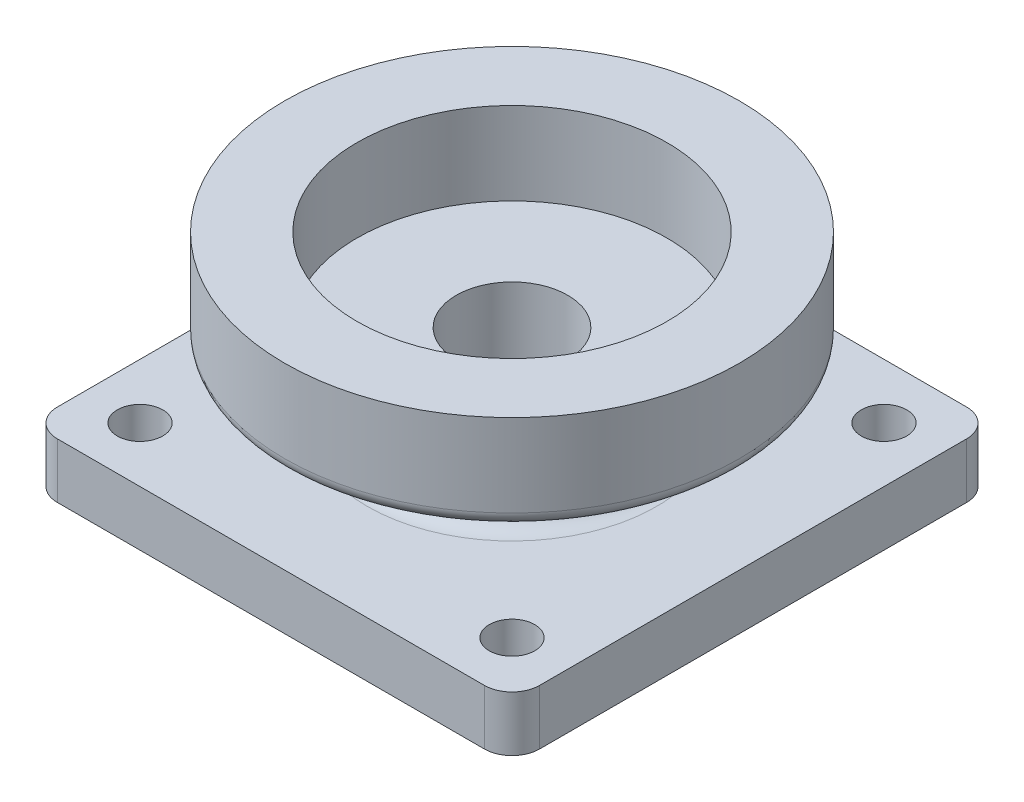
ISO-10303-21;
HEADER;
FILE_DESCRIPTION(('STEP AP214'),'2;1');
FILE_NAME('part.step','',(''),(''),'','','');
FILE_SCHEMA(('AUTOMOTIVE_DESIGN { 1 0 10303 214 1 1 1 1 }'));
ENDSEC;
DATA;
#1=APPLICATION_CONTEXT('core data for automotive mechanical design processes');
#2=APPLICATION_PROTOCOL_DEFINITION('international standard','automotive_design',2000,#1);
#3=PRODUCT_CONTEXT('',#1,'mechanical');
#4=PRODUCT('Part','Part','',(#3));
#5=PRODUCT_RELATED_PRODUCT_CATEGORY('part','',(#4));
#6=PRODUCT_DEFINITION_FORMATION('','',#4);
#7=PRODUCT_DEFINITION_CONTEXT('part definition',#1,'design');
#8=PRODUCT_DEFINITION('design','',#6,#7);
#9=PRODUCT_DEFINITION_SHAPE('','',#8);
#10=(LENGTH_UNIT() NAMED_UNIT(*) SI_UNIT(.MILLI.,.METRE.));
#11=(NAMED_UNIT(*) PLANE_ANGLE_UNIT() SI_UNIT($,.RADIAN.));
#12=(NAMED_UNIT(*) SI_UNIT($,.STERADIAN.) SOLID_ANGLE_UNIT());
#13=UNCERTAINTY_MEASURE_WITH_UNIT(LENGTH_MEASURE(1.E-05),#10,'distance_accuracy_value','');
#14=(GEOMETRIC_REPRESENTATION_CONTEXT(3) GLOBAL_UNCERTAINTY_ASSIGNED_CONTEXT((#13)) GLOBAL_UNIT_ASSIGNED_CONTEXT((#10,
#11,#12)) REPRESENTATION_CONTEXT('',''));
#15=CARTESIAN_POINT('',(0.,0.,0.));
#16=DIRECTION('',(0.,0.,1.));
#17=DIRECTION('',(1.,0.,0.));
#18=AXIS2_PLACEMENT_3D('',#15,#16,#17);
#19=CARTESIAN_POINT('',(17.5,4.,0.));
#20=DIRECTION('',(1.,0.,0.));
#21=DIRECTION('',(0.,0.,-1.));
#22=AXIS2_PLACEMENT_3D('',#19,#20,#21);
#23=PLANE('',#22);
#24=DIRECTION('',(0.,0.,1.));
#25=VECTOR('',#24,1.);
#26=CARTESIAN_POINT('',(17.5,0.,0.));
#27=LINE('',#26,#25);
#28=CARTESIAN_POINT('',(17.5,0.,-15.5));
#29=VERTEX_POINT('',#28);
#30=CARTESIAN_POINT('',(17.5,0.,15.5));
#31=VERTEX_POINT('',#30);
#32=EDGE_CURVE('E139',#29,#31,#27,.T.);
#33=ORIENTED_EDGE('',*,*,#32,.F.);
#34=DIRECTION('',(0.,-1.,0.));
#35=VECTOR('',#34,1.);
#36=CARTESIAN_POINT('',(17.5,4.,-15.5));
#37=LINE('',#36,#35);
#38=CARTESIAN_POINT('',(17.5,4.,-15.5));
#39=VERTEX_POINT('',#38);
#40=EDGE_CURVE('E167',#29,#39,#37,.F.);
#41=ORIENTED_EDGE('',*,*,#40,.T.);
#42=DIRECTION('',(0.,0.,1.));
#43=VECTOR('',#42,1.);
#44=CARTESIAN_POINT('',(17.5,4.,0.));
#45=LINE('',#44,#43);
#46=CARTESIAN_POINT('',(17.5,4.,15.5));
#47=VERTEX_POINT('',#46);
#48=EDGE_CURVE('E308',#39,#47,#45,.T.);
#49=ORIENTED_EDGE('',*,*,#48,.T.);
#50=DIRECTION('',(0.,-1.,0.));
#51=VECTOR('',#50,1.);
#52=CARTESIAN_POINT('',(17.5,0.,15.5));
#53=LINE('',#52,#51);
#54=EDGE_CURVE('E163',#47,#31,#53,.T.);
#55=ORIENTED_EDGE('',*,*,#54,.T.);
#56=EDGE_LOOP('',(#33,#41,#49,#55));
#57=FACE_BOUND('',#56,.T.);
#58=ADVANCED_FACE('F47',(#57),#23,.T.);
#59=CARTESIAN_POINT('',(0.,4.,-17.5));
#60=DIRECTION('',(0.,0.,-1.));
#61=DIRECTION('',(-1.,0.,0.));
#62=AXIS2_PLACEMENT_3D('',#59,#60,#61);
#63=PLANE('',#62);
#64=DIRECTION('',(1.,0.,0.));
#65=VECTOR('',#64,1.);
#66=CARTESIAN_POINT('',(0.,4.,-17.5));
#67=LINE('',#66,#65);
#68=CARTESIAN_POINT('',(-15.5,4.,-17.5));
#69=VERTEX_POINT('',#68);
#70=CARTESIAN_POINT('',(15.5,4.,-17.5));
#71=VERTEX_POINT('',#70);
#72=EDGE_CURVE('E313',#69,#71,#67,.T.);
#73=ORIENTED_EDGE('',*,*,#72,.T.);
#74=DIRECTION('',(0.,-1.,0.));
#75=VECTOR('',#74,1.);
#76=CARTESIAN_POINT('',(15.5,4.,-17.5));
#77=LINE('',#76,#75);
#78=CARTESIAN_POINT('',(15.5,0.,-17.5));
#79=VERTEX_POINT('',#78);
#80=EDGE_CURVE('E137',#71,#79,#77,.T.);
#81=ORIENTED_EDGE('',*,*,#80,.T.);
#82=DIRECTION('',(1.,0.,0.));
#83=VECTOR('',#82,1.);
#84=CARTESIAN_POINT('',(0.,0.,-17.5));
#85=LINE('',#84,#83);
#86=CARTESIAN_POINT('',(-15.5,0.,-17.5));
#87=VERTEX_POINT('',#86);
#88=EDGE_CURVE('E119',#87,#79,#85,.T.);
#89=ORIENTED_EDGE('',*,*,#88,.F.);
#90=DIRECTION('',(0.,-1.,0.));
#91=VECTOR('',#90,1.);
#92=CARTESIAN_POINT('',(-15.5,4.,-17.5));
#93=LINE('',#92,#91);
#94=EDGE_CURVE('E134',#87,#69,#93,.F.);
#95=ORIENTED_EDGE('',*,*,#94,.T.);
#96=EDGE_LOOP('',(#73,#81,#89,#95));
#97=FACE_BOUND('',#96,.T.);
#98=ADVANCED_FACE('F133',(#97),#63,.T.);
#99=CARTESIAN_POINT('',(-17.5,4.,0.));
#100=DIRECTION('',(1.,0.,0.));
#101=DIRECTION('',(0.,0.,-1.));
#102=AXIS2_PLACEMENT_3D('',#99,#100,#101);
#103=PLANE('',#102);
#104=DIRECTION('',(0.,0.,1.));
#105=VECTOR('',#104,1.);
#106=CARTESIAN_POINT('',(-17.5,4.,0.));
#107=LINE('',#106,#105);
#108=CARTESIAN_POINT('',(-17.5,4.,-15.5));
#109=VERTEX_POINT('',#108);
#110=CARTESIAN_POINT('',(-17.5,4.,15.5));
#111=VERTEX_POINT('',#110);
#112=EDGE_CURVE('E151',#109,#111,#107,.T.);
#113=ORIENTED_EDGE('',*,*,#112,.F.);
#114=DIRECTION('',(0.,-1.,0.));
#115=VECTOR('',#114,1.);
#116=CARTESIAN_POINT('',(-17.5,0.,-15.5));
#117=LINE('',#116,#115);
#118=CARTESIAN_POINT('',(-17.5,0.,-15.5));
#119=VERTEX_POINT('',#118);
#120=EDGE_CURVE('E183',#109,#119,#117,.T.);
#121=ORIENTED_EDGE('',*,*,#120,.T.);
#122=DIRECTION('',(0.,0.,1.));
#123=VECTOR('',#122,1.);
#124=CARTESIAN_POINT('',(-17.5,0.,0.));
#125=LINE('',#124,#123);
#126=CARTESIAN_POINT('',(-17.5,0.,15.5));
#127=VERTEX_POINT('',#126);
#128=EDGE_CURVE('E121',#119,#127,#125,.T.);
#129=ORIENTED_EDGE('',*,*,#128,.T.);
#130=DIRECTION('',(0.,-1.,0.));
#131=VECTOR('',#130,1.);
#132=CARTESIAN_POINT('',(-17.5,4.,15.5));
#133=LINE('',#132,#131);
#134=EDGE_CURVE('E180',#127,#111,#133,.F.);
#135=ORIENTED_EDGE('',*,*,#134,.T.);
#136=EDGE_LOOP('',(#113,#121,#129,#135));
#137=FACE_BOUND('',#136,.T.);
#138=ADVANCED_FACE('F231',(#137),#103,.F.);
#139=CARTESIAN_POINT('',(-13.5,4.,13.5));
#140=DIRECTION('',(0.,-1.,0.));
#141=DIRECTION('',(0.,0.,-1.));
#142=AXIS2_PLACEMENT_3D('',#139,#140,#141);
#143=CYLINDRICAL_SURFACE('',#142,1.65);
#144=CARTESIAN_POINT('',(-13.5,4.,13.5));
#145=DIRECTION('',(0.,1.,0.));
#146=DIRECTION('',(0.,0.,1.));
#147=AXIS2_PLACEMENT_3D('',#144,#145,#146);
#148=CIRCLE('',#147,1.65);
#149=CARTESIAN_POINT('',(-13.5,4.,15.15));
#150=VERTEX_POINT('',#149);
#151=EDGE_CURVE('E305',#150,#150,#148,.T.);
#152=ORIENTED_EDGE('',*,*,#151,.T.);
#153=EDGE_LOOP('',(#152));
#154=FACE_BOUND('',#153,.T.);
#155=CARTESIAN_POINT('',(-13.5,0.,13.5));
#156=DIRECTION('',(0.,1.,0.));
#157=DIRECTION('',(0.,0.,1.));
#158=AXIS2_PLACEMENT_3D('',#155,#156,#157);
#159=CIRCLE('',#158,1.65);
#160=CARTESIAN_POINT('',(-13.5,0.,15.15));
#161=VERTEX_POINT('',#160);
#162=EDGE_CURVE('E318',#161,#161,#159,.T.);
#163=ORIENTED_EDGE('',*,*,#162,.F.);
#164=EDGE_LOOP('',(#163));
#165=FACE_BOUND('',#164,.T.);
#166=ADVANCED_FACE('F236',(#154,#165),#143,.F.);
#167=CARTESIAN_POINT('',(13.5,4.,13.5));
#168=DIRECTION('',(0.,-1.,0.));
#169=DIRECTION('',(0.,0.,-1.));
#170=AXIS2_PLACEMENT_3D('',#167,#168,#169);
#171=CYLINDRICAL_SURFACE('',#170,1.65);
#172=CARTESIAN_POINT('',(13.5,4.,13.5));
#173=DIRECTION('',(0.,1.,0.));
#174=DIRECTION('',(0.,0.,1.));
#175=AXIS2_PLACEMENT_3D('',#172,#173,#174);
#176=CIRCLE('',#175,1.65);
#177=CARTESIAN_POINT('',(13.5,4.,15.15));
#178=VERTEX_POINT('',#177);
#179=EDGE_CURVE('E302',#178,#178,#176,.T.);
#180=ORIENTED_EDGE('',*,*,#179,.T.);
#181=EDGE_LOOP('',(#180));
#182=FACE_BOUND('',#181,.T.);
#183=CARTESIAN_POINT('',(13.5,0.,13.5));
#184=DIRECTION('',(0.,1.,0.));
#185=DIRECTION('',(0.,0.,1.));
#186=AXIS2_PLACEMENT_3D('',#183,#184,#185);
#187=CIRCLE('',#186,1.65);
#188=CARTESIAN_POINT('',(13.5,0.,15.15));
#189=VERTEX_POINT('',#188);
#190=EDGE_CURVE('E322',#189,#189,#187,.T.);
#191=ORIENTED_EDGE('',*,*,#190,.F.);
#192=EDGE_LOOP('',(#191));
#193=FACE_BOUND('',#192,.T.);
#194=ADVANCED_FACE('F239',(#182,#193),#171,.F.);
#195=CARTESIAN_POINT('',(13.5,4.,-13.5));
#196=DIRECTION('',(0.,-1.,0.));
#197=DIRECTION('',(0.,0.,-1.));
#198=AXIS2_PLACEMENT_3D('',#195,#196,#197);
#199=CYLINDRICAL_SURFACE('',#198,1.65);
#200=CARTESIAN_POINT('',(13.5,4.,-13.5));
#201=DIRECTION('',(0.,1.,0.));
#202=DIRECTION('',(0.,0.,1.));
#203=AXIS2_PLACEMENT_3D('',#200,#201,#202);
#204=CIRCLE('',#203,1.65);
#205=CARTESIAN_POINT('',(13.5,4.,-11.85));
#206=VERTEX_POINT('',#205);
#207=EDGE_CURVE('E298',#206,#206,#204,.T.);
#208=ORIENTED_EDGE('',*,*,#207,.T.);
#209=EDGE_LOOP('',(#208));
#210=FACE_BOUND('',#209,.T.);
#211=CARTESIAN_POINT('',(13.5,0.,-13.5));
#212=DIRECTION('',(0.,1.,0.));
#213=DIRECTION('',(0.,0.,1.));
#214=AXIS2_PLACEMENT_3D('',#211,#212,#213);
#215=CIRCLE('',#214,1.65);
#216=CARTESIAN_POINT('',(13.5,0.,-11.85));
#217=VERTEX_POINT('',#216);
#218=EDGE_CURVE('E350',#217,#217,#215,.T.);
#219=ORIENTED_EDGE('',*,*,#218,.F.);
#220=EDGE_LOOP('',(#219));
#221=FACE_BOUND('',#220,.T.);
#222=ADVANCED_FACE('F243',(#210,#221),#199,.F.);
#223=CARTESIAN_POINT('',(-13.5,4.,-13.5));
#224=DIRECTION('',(0.,-1.,0.));
#225=DIRECTION('',(0.,0.,-1.));
#226=AXIS2_PLACEMENT_3D('',#223,#224,#225);
#227=CYLINDRICAL_SURFACE('',#226,1.65);
#228=CARTESIAN_POINT('',(-13.5,4.,-13.5));
#229=DIRECTION('',(0.,1.,0.));
#230=DIRECTION('',(0.,0.,1.));
#231=AXIS2_PLACEMENT_3D('',#228,#229,#230);
#232=CIRCLE('',#231,1.65);
#233=CARTESIAN_POINT('',(-13.5,4.,-11.85));
#234=VERTEX_POINT('',#233);
#235=EDGE_CURVE('E294',#234,#234,#232,.T.);
#236=ORIENTED_EDGE('',*,*,#235,.T.);
#237=EDGE_LOOP('',(#236));
#238=FACE_BOUND('',#237,.T.);
#239=CARTESIAN_POINT('',(-13.5,0.,-13.5));
#240=DIRECTION('',(0.,1.,0.));
#241=DIRECTION('',(0.,0.,1.));
#242=AXIS2_PLACEMENT_3D('',#239,#240,#241);
#243=CIRCLE('',#242,1.65);
#244=CARTESIAN_POINT('',(-13.5,0.,-11.85));
#245=VERTEX_POINT('',#244);
#246=EDGE_CURVE('E346',#245,#245,#243,.T.);
#247=ORIENTED_EDGE('',*,*,#246,.F.);
#248=EDGE_LOOP('',(#247));
#249=FACE_BOUND('',#248,.T.);
#250=ADVANCED_FACE('F247',(#238,#249),#227,.F.);
#251=CARTESIAN_POINT('',(0.,4.,17.5));
#252=DIRECTION('',(0.,0.,-1.));
#253=DIRECTION('',(-1.,0.,0.));
#254=AXIS2_PLACEMENT_3D('',#251,#252,#253);
#255=PLANE('',#254);
#256=DIRECTION('',(1.,0.,0.));
#257=VECTOR('',#256,1.);
#258=CARTESIAN_POINT('',(0.,0.,17.5));
#259=LINE('',#258,#257);
#260=CARTESIAN_POINT('',(-15.5,0.,17.5));
#261=VERTEX_POINT('',#260);
#262=CARTESIAN_POINT('',(15.5,0.,17.5));
#263=VERTEX_POINT('',#262);
#264=EDGE_CURVE('E154',#261,#263,#259,.T.);
#265=ORIENTED_EDGE('',*,*,#264,.T.);
#266=DIRECTION('',(0.,-1.,0.));
#267=VECTOR('',#266,1.);
#268=CARTESIAN_POINT('',(15.5,4.,17.5));
#269=LINE('',#268,#267);
#270=CARTESIAN_POINT('',(15.5,4.,17.5));
#271=VERTEX_POINT('',#270);
#272=EDGE_CURVE('E63',#263,#271,#269,.F.);
#273=ORIENTED_EDGE('',*,*,#272,.T.);
#274=DIRECTION('',(1.,0.,0.));
#275=VECTOR('',#274,1.);
#276=CARTESIAN_POINT('',(0.,4.,17.5));
#277=LINE('',#276,#275);
#278=CARTESIAN_POINT('',(-15.5,4.,17.5));
#279=VERTEX_POINT('',#278);
#280=EDGE_CURVE('E145',#279,#271,#277,.T.);
#281=ORIENTED_EDGE('',*,*,#280,.F.);
#282=DIRECTION('',(0.,-1.,0.));
#283=VECTOR('',#282,1.);
#284=CARTESIAN_POINT('',(-15.5,4.,17.5));
#285=LINE('',#284,#283);
#286=EDGE_CURVE('E186',#279,#261,#285,.T.);
#287=ORIENTED_EDGE('',*,*,#286,.T.);
#288=EDGE_LOOP('',(#265,#273,#281,#287));
#289=FACE_BOUND('',#288,.T.);
#290=ADVANCED_FACE('F250',(#289),#255,.F.);
#291=CARTESIAN_POINT('',(0.,4.,0.));
#292=DIRECTION('',(0.,1.,0.));
#293=DIRECTION('',(0.,0.,1.));
#294=AXIS2_PLACEMENT_3D('',#291,#292,#293);
#295=PLANE('',#294);
#296=CARTESIAN_POINT('',(0.,4.,0.));
#297=DIRECTION('',(0.,1.,0.));
#298=DIRECTION('',(0.,0.,1.));
#299=AXIS2_PLACEMENT_3D('',#296,#297,#298);
#300=CIRCLE('',#299,10.5);
#301=CARTESIAN_POINT('',(0.,4.,10.5));
#302=VERTEX_POINT('',#301);
#303=EDGE_CURVE('E196',#302,#302,#300,.F.);
#304=ORIENTED_EDGE('',*,*,#303,.T.);
#305=EDGE_LOOP('',(#304));
#306=FACE_BOUND('',#305,.T.);
#307=ORIENTED_EDGE('',*,*,#235,.F.);
#308=EDGE_LOOP('',(#307));
#309=FACE_BOUND('',#308,.T.);
#310=ORIENTED_EDGE('',*,*,#207,.F.);
#311=EDGE_LOOP('',(#310));
#312=FACE_BOUND('',#311,.T.);
#313=ORIENTED_EDGE('',*,*,#179,.F.);
#314=EDGE_LOOP('',(#313));
#315=FACE_BOUND('',#314,.T.);
#316=ORIENTED_EDGE('',*,*,#151,.F.);
#317=EDGE_LOOP('',(#316));
#318=FACE_BOUND('',#317,.T.);
#319=ORIENTED_EDGE('',*,*,#48,.F.);
#320=CARTESIAN_POINT('',(15.5,4.,-15.5));
#321=DIRECTION('',(0.,1.,0.));
#322=DIRECTION('',(0.,0.,1.));
#323=AXIS2_PLACEMENT_3D('',#320,#321,#322);
#324=CIRCLE('',#323,2.);
#325=EDGE_CURVE('E177',#39,#71,#324,.T.);
#326=ORIENTED_EDGE('',*,*,#325,.T.);
#327=ORIENTED_EDGE('',*,*,#72,.F.);
#328=CARTESIAN_POINT('',(-15.5,4.,-15.5));
#329=DIRECTION('',(0.,1.,0.));
#330=DIRECTION('',(0.,0.,1.));
#331=AXIS2_PLACEMENT_3D('',#328,#329,#330);
#332=CIRCLE('',#331,2.);
#333=EDGE_CURVE('E143',#69,#109,#332,.T.);
#334=ORIENTED_EDGE('',*,*,#333,.T.);
#335=ORIENTED_EDGE('',*,*,#112,.T.);
#336=CARTESIAN_POINT('',(-15.5,4.,15.5));
#337=DIRECTION('',(0.,1.,0.));
#338=DIRECTION('',(0.,0.,1.));
#339=AXIS2_PLACEMENT_3D('',#336,#337,#338);
#340=CIRCLE('',#339,2.);
#341=EDGE_CURVE('E70',#111,#279,#340,.T.);
#342=ORIENTED_EDGE('',*,*,#341,.T.);
#343=ORIENTED_EDGE('',*,*,#280,.T.);
#344=CARTESIAN_POINT('',(15.5,4.,15.5));
#345=DIRECTION('',(0.,1.,0.));
#346=DIRECTION('',(0.,0.,1.));
#347=AXIS2_PLACEMENT_3D('',#344,#345,#346);
#348=CIRCLE('',#347,2.);
#349=EDGE_CURVE('E172',#271,#47,#348,.T.);
#350=ORIENTED_EDGE('',*,*,#349,.T.);
#351=EDGE_LOOP('',(#319,#326,#327,#334,#335,#342,#343,#350));
#352=FACE_BOUND('',#351,.T.);
#353=ADVANCED_FACE('F288',(#306,#309,#312,#315,#318,#352),#295,.T.);
#354=CARTESIAN_POINT('',(0.,0.,0.));
#355=DIRECTION('',(0.,1.,0.));
#356=DIRECTION('',(0.,0.,1.));
#357=AXIS2_PLACEMENT_3D('',#354,#355,#356);
#358=PLANE('',#357);
#359=ORIENTED_EDGE('',*,*,#246,.T.);
#360=EDGE_LOOP('',(#359));
#361=FACE_BOUND('',#360,.T.);
#362=ORIENTED_EDGE('',*,*,#218,.T.);
#363=EDGE_LOOP('',(#362));
#364=FACE_BOUND('',#363,.T.);
#365=ORIENTED_EDGE('',*,*,#190,.T.);
#366=EDGE_LOOP('',(#365));
#367=FACE_BOUND('',#366,.T.);
#368=ORIENTED_EDGE('',*,*,#162,.T.);
#369=EDGE_LOOP('',(#368));
#370=FACE_BOUND('',#369,.T.);
#371=ORIENTED_EDGE('',*,*,#88,.T.);
#372=CARTESIAN_POINT('',(15.5,0.,-15.5));
#373=DIRECTION('',(0.,1.,0.));
#374=DIRECTION('',(0.,0.,1.));
#375=AXIS2_PLACEMENT_3D('',#372,#373,#374);
#376=CIRCLE('',#375,2.);
#377=EDGE_CURVE('E127',#79,#29,#376,.F.);
#378=ORIENTED_EDGE('',*,*,#377,.T.);
#379=ORIENTED_EDGE('',*,*,#32,.T.);
#380=CARTESIAN_POINT('',(15.5,0.,15.5));
#381=DIRECTION('',(0.,1.,0.));
#382=DIRECTION('',(0.,0.,1.));
#383=AXIS2_PLACEMENT_3D('',#380,#381,#382);
#384=CIRCLE('',#383,2.);
#385=EDGE_CURVE('E128',#31,#263,#384,.F.);
#386=ORIENTED_EDGE('',*,*,#385,.T.);
#387=ORIENTED_EDGE('',*,*,#264,.F.);
#388=CARTESIAN_POINT('',(-15.5,0.,15.5));
#389=DIRECTION('',(0.,1.,0.));
#390=DIRECTION('',(0.,0.,1.));
#391=AXIS2_PLACEMENT_3D('',#388,#389,#390);
#392=CIRCLE('',#391,2.);
#393=EDGE_CURVE('E149',#261,#127,#392,.F.);
#394=ORIENTED_EDGE('',*,*,#393,.T.);
#395=ORIENTED_EDGE('',*,*,#128,.F.);
#396=CARTESIAN_POINT('',(-15.5,0.,-15.5));
#397=DIRECTION('',(0.,1.,0.));
#398=DIRECTION('',(0.,0.,1.));
#399=AXIS2_PLACEMENT_3D('',#396,#397,#398);
#400=CIRCLE('',#399,2.);
#401=EDGE_CURVE('E115',#119,#87,#400,.F.);
#402=ORIENTED_EDGE('',*,*,#401,.T.);
#403=EDGE_LOOP('',(#371,#378,#379,#386,#387,#394,#395,#402));
#404=FACE_BOUND('',#403,.T.);
#405=CARTESIAN_POINT('',(0.,0.,0.));
#406=DIRECTION('',(0.,1.,0.));
#407=DIRECTION('',(0.,0.,1.));
#408=AXIS2_PLACEMENT_3D('',#405,#406,#407);
#409=CIRCLE('',#408,4.05);
#410=CARTESIAN_POINT('',(0.,0.,4.05000000000001));
#411=VERTEX_POINT('',#410);
#412=EDGE_CURVE('E335',#411,#411,#409,.T.);
#413=ORIENTED_EDGE('',*,*,#412,.T.);
#414=EDGE_LOOP('',(#413));
#415=FACE_BOUND('',#414,.T.);
#416=ADVANCED_FACE('F117',(#361,#364,#367,#370,#404,#415),#358,.F.);
#417=CARTESIAN_POINT('',(15.5,4.,-15.5));
#418=DIRECTION('',(0.,-1.,0.));
#419=DIRECTION('',(0.,0.,-1.));
#420=AXIS2_PLACEMENT_3D('',#417,#418,#419);
#421=CYLINDRICAL_SURFACE('',#420,2.);
#422=ORIENTED_EDGE('',*,*,#325,.F.);
#423=ORIENTED_EDGE('',*,*,#40,.F.);
#424=ORIENTED_EDGE('',*,*,#377,.F.);
#425=ORIENTED_EDGE('',*,*,#80,.F.);
#426=EDGE_LOOP('',(#422,#423,#424,#425));
#427=FACE_BOUND('',#426,.T.);
#428=ADVANCED_FACE('F252',(#427),#421,.T.);
#429=CARTESIAN_POINT('',(-15.5,4.,-15.5));
#430=DIRECTION('',(0.,1.,0.));
#431=DIRECTION('',(0.,0.,1.));
#432=AXIS2_PLACEMENT_3D('',#429,#430,#431);
#433=CYLINDRICAL_SURFACE('',#432,2.);
#434=ORIENTED_EDGE('',*,*,#333,.F.);
#435=ORIENTED_EDGE('',*,*,#94,.F.);
#436=ORIENTED_EDGE('',*,*,#401,.F.);
#437=ORIENTED_EDGE('',*,*,#120,.F.);
#438=EDGE_LOOP('',(#434,#435,#436,#437));
#439=FACE_BOUND('',#438,.T.);
#440=ADVANCED_FACE('F142',(#439),#433,.T.);
#441=CARTESIAN_POINT('',(15.5,4.,15.5));
#442=DIRECTION('',(0.,1.,0.));
#443=DIRECTION('',(0.,0.,1.));
#444=AXIS2_PLACEMENT_3D('',#441,#442,#443);
#445=CYLINDRICAL_SURFACE('',#444,2.);
#446=ORIENTED_EDGE('',*,*,#349,.F.);
#447=ORIENTED_EDGE('',*,*,#272,.F.);
#448=ORIENTED_EDGE('',*,*,#385,.F.);
#449=ORIENTED_EDGE('',*,*,#54,.F.);
#450=EDGE_LOOP('',(#446,#447,#448,#449));
#451=FACE_BOUND('',#450,.T.);
#452=ADVANCED_FACE('F258',(#451),#445,.T.);
#453=CARTESIAN_POINT('',(-15.5,4.,15.5));
#454=DIRECTION('',(0.,-1.,0.));
#455=DIRECTION('',(0.,0.,-1.));
#456=AXIS2_PLACEMENT_3D('',#453,#454,#455);
#457=CYLINDRICAL_SURFACE('',#456,2.);
#458=ORIENTED_EDGE('',*,*,#341,.F.);
#459=ORIENTED_EDGE('',*,*,#134,.F.);
#460=ORIENTED_EDGE('',*,*,#393,.F.);
#461=ORIENTED_EDGE('',*,*,#286,.F.);
#462=EDGE_LOOP('',(#458,#459,#460,#461));
#463=FACE_BOUND('',#462,.T.);
#464=ADVANCED_FACE('F261',(#463),#457,.T.);
#465=CARTESIAN_POINT('',(0.,9.,0.));
#466=DIRECTION('',(0.,-1.,0.));
#467=DIRECTION('',(0.,0.,-1.));
#468=AXIS2_PLACEMENT_3D('',#465,#466,#467);
#469=CYLINDRICAL_SURFACE('',#468,4.05);
#470=ORIENTED_EDGE('',*,*,#412,.F.);
#471=EDGE_LOOP('',(#470));
#472=FACE_BOUND('',#471,.T.);
#473=CARTESIAN_POINT('',(0.,10.,0.));
#474=DIRECTION('',(0.,1.,0.));
#475=DIRECTION('',(0.,0.,1.));
#476=AXIS2_PLACEMENT_3D('',#473,#474,#475);
#477=CIRCLE('',#476,4.05);
#478=CARTESIAN_POINT('',(0.,10.,4.05000000000001));
#479=VERTEX_POINT('',#478);
#480=EDGE_CURVE('E514',#479,#479,#477,.F.);
#481=ORIENTED_EDGE('',*,*,#480,.F.);
#482=EDGE_LOOP('',(#481));
#483=FACE_BOUND('',#482,.T.);
#484=ADVANCED_FACE('F265',(#472,#483),#469,.F.);
#485=CARTESIAN_POINT('',(0.,9.,0.));
#486=DIRECTION('',(0.,-1.,0.));
#487=DIRECTION('',(0.,0.,-1.));
#488=AXIS2_PLACEMENT_3D('',#485,#486,#487);
#489=CYLINDRICAL_SURFACE('',#488,9.);
#490=CARTESIAN_POINT('',(0.,7.5,0.));
#491=DIRECTION('',(0.,1.,0.));
#492=DIRECTION('',(0.,0.,1.));
#493=AXIS2_PLACEMENT_3D('',#490,#491,#492);
#494=CIRCLE('',#493,9.);
#495=CARTESIAN_POINT('',(0.,7.5,9.00000000000001));
#496=VERTEX_POINT('',#495);
#497=EDGE_CURVE('E204',#496,#496,#494,.F.);
#498=ORIENTED_EDGE('',*,*,#497,.T.);
#499=EDGE_LOOP('',(#498));
#500=FACE_BOUND('',#499,.T.);
#501=CARTESIAN_POINT('',(0.,5.5,0.));
#502=DIRECTION('',(0.,1.,0.));
#503=DIRECTION('',(0.,0.,1.));
#504=AXIS2_PLACEMENT_3D('',#501,#502,#503);
#505=CIRCLE('',#504,9.);
#506=CARTESIAN_POINT('',(0.,5.5,9.00000000000001));
#507=VERTEX_POINT('',#506);
#508=EDGE_CURVE('E192',#507,#507,#505,.T.);
#509=ORIENTED_EDGE('',*,*,#508,.T.);
#510=EDGE_LOOP('',(#509));
#511=FACE_BOUND('',#510,.T.);
#512=ADVANCED_FACE('F270',(#500,#511),#489,.T.);
#513=CARTESIAN_POINT('',(0.,5.5,0.));
#514=DIRECTION('',(0.,1.,0.));
#515=DIRECTION('',(0.,0.,1.));
#516=AXIS2_PLACEMENT_3D('',#513,#514,#515);
#517=TOROIDAL_SURFACE('',#516,10.5,1.5);
#518=ORIENTED_EDGE('',*,*,#303,.F.);
#519=EDGE_LOOP('',(#518));
#520=FACE_BOUND('',#519,.T.);
#521=ORIENTED_EDGE('',*,*,#508,.F.);
#522=EDGE_LOOP('',(#521));
#523=FACE_BOUND('',#522,.T.);
#524=ADVANCED_FACE('F267',(#520,#523),#517,.F.);
#525=CARTESIAN_POINT('',(0.,10.,0.));
#526=DIRECTION('',(0.,1.,0.));
#527=DIRECTION('',(0.,0.,1.));
#528=AXIS2_PLACEMENT_3D('',#525,#526,#527);
#529=PLANE('',#528);
#530=CARTESIAN_POINT('',(0.,10.,0.));
#531=DIRECTION('',(0.,1.,0.));
#532=DIRECTION('',(0.,0.,1.));
#533=AXIS2_PLACEMENT_3D('',#530,#531,#532);
#534=CIRCLE('',#533,11.25);
#535=CARTESIAN_POINT('',(0.,10.,11.25));
#536=VERTEX_POINT('',#535);
#537=EDGE_CURVE('E501',#536,#536,#534,.F.);
#538=ORIENTED_EDGE('',*,*,#537,.F.);
#539=EDGE_LOOP('',(#538));
#540=FACE_BOUND('',#539,.T.);
#541=ORIENTED_EDGE('',*,*,#480,.T.);
#542=EDGE_LOOP('',(#541));
#543=FACE_BOUND('',#542,.T.);
#544=ADVANCED_FACE('F269',(#540,#543),#529,.T.);
#545=CARTESIAN_POINT('',(0.,9.,0.));
#546=DIRECTION('',(0.,1.,0.));
#547=DIRECTION('',(0.,0.,1.));
#548=AXIS2_PLACEMENT_3D('',#545,#546,#547);
#549=PLANE('',#548);
#550=CARTESIAN_POINT('',(0.,9.,0.));
#551=DIRECTION('',(0.,1.,0.));
#552=DIRECTION('',(0.,0.,1.));
#553=AXIS2_PLACEMENT_3D('',#550,#551,#552);
#554=CIRCLE('',#553,15.5);
#555=CARTESIAN_POINT('',(0.,9.,15.5));
#556=VERTEX_POINT('',#555);
#557=EDGE_CURVE('E11',#556,#556,#554,.F.);
#558=ORIENTED_EDGE('',*,*,#557,.T.);
#559=EDGE_LOOP('',(#558));
#560=FACE_BOUND('',#559,.T.);
#561=CARTESIAN_POINT('',(0.,9.,0.));
#562=DIRECTION('',(0.,1.,0.));
#563=DIRECTION('',(0.,0.,1.));
#564=AXIS2_PLACEMENT_3D('',#561,#562,#563);
#565=CIRCLE('',#564,10.5);
#566=CARTESIAN_POINT('',(0.,9.,10.5));
#567=VERTEX_POINT('',#566);
#568=EDGE_CURVE('E200',#567,#567,#565,.T.);
#569=ORIENTED_EDGE('',*,*,#568,.T.);
#570=EDGE_LOOP('',(#569));
#571=FACE_BOUND('',#570,.T.);
#572=ADVANCED_FACE('F277',(#560,#571),#549,.F.);
#573=CARTESIAN_POINT('',(0.,16.,0.));
#574=DIRECTION('',(0.,1.,0.));
#575=DIRECTION('',(0.,0.,1.));
#576=AXIS2_PLACEMENT_3D('',#573,#574,#575);
#577=PLANE('',#576);
#578=CARTESIAN_POINT('',(0.,16.,0.));
#579=DIRECTION('',(0.,1.,0.));
#580=DIRECTION('',(0.,0.,1.));
#581=AXIS2_PLACEMENT_3D('',#578,#579,#580);
#582=CIRCLE('',#581,16.5);
#583=CARTESIAN_POINT('',(0.,16.,16.5));
#584=VERTEX_POINT('',#583);
#585=EDGE_CURVE('E507',#584,#584,#582,.T.);
#586=ORIENTED_EDGE('',*,*,#585,.T.);
#587=EDGE_LOOP('',(#586));
#588=FACE_BOUND('',#587,.T.);
#589=CARTESIAN_POINT('',(0.,16.,0.));
#590=DIRECTION('',(0.,1.,0.));
#591=DIRECTION('',(0.,0.,1.));
#592=AXIS2_PLACEMENT_3D('',#589,#590,#591);
#593=CIRCLE('',#592,11.25);
#594=CARTESIAN_POINT('',(0.,16.,11.25));
#595=VERTEX_POINT('',#594);
#596=EDGE_CURVE('E504',#595,#595,#593,.T.);
#597=ORIENTED_EDGE('',*,*,#596,.F.);
#598=EDGE_LOOP('',(#597));
#599=FACE_BOUND('',#598,.T.);
#600=ADVANCED_FACE('F439',(#588,#599),#577,.T.);
#601=CARTESIAN_POINT('',(0.,16.,0.));
#602=DIRECTION('',(0.,-1.,0.));
#603=DIRECTION('',(0.,0.,-1.));
#604=AXIS2_PLACEMENT_3D('',#601,#602,#603);
#605=CYLINDRICAL_SURFACE('',#604,16.5);
#606=CARTESIAN_POINT('',(0.,10.,0.));
#607=DIRECTION('',(0.,1.,0.));
#608=DIRECTION('',(0.,0.,1.));
#609=AXIS2_PLACEMENT_3D('',#606,#607,#608);
#610=CIRCLE('',#609,16.5);
#611=CARTESIAN_POINT('',(0.,10.,16.5));
#612=VERTEX_POINT('',#611);
#613=EDGE_CURVE('E56',#612,#612,#610,.T.);
#614=ORIENTED_EDGE('',*,*,#613,.T.);
#615=EDGE_LOOP('',(#614));
#616=FACE_BOUND('',#615,.T.);
#617=ORIENTED_EDGE('',*,*,#585,.F.);
#618=EDGE_LOOP('',(#617));
#619=FACE_BOUND('',#618,.T.);
#620=ADVANCED_FACE('F211',(#616,#619),#605,.T.);
#621=CARTESIAN_POINT('',(0.,16.,0.));
#622=DIRECTION('',(0.,-1.,0.));
#623=DIRECTION('',(0.,0.,-1.));
#624=AXIS2_PLACEMENT_3D('',#621,#622,#623);
#625=CYLINDRICAL_SURFACE('',#624,11.25);
#626=ORIENTED_EDGE('',*,*,#537,.T.);
#627=EDGE_LOOP('',(#626));
#628=FACE_BOUND('',#627,.T.);
#629=ORIENTED_EDGE('',*,*,#596,.T.);
#630=EDGE_LOOP('',(#629));
#631=FACE_BOUND('',#630,.T.);
#632=ADVANCED_FACE('F221',(#628,#631),#625,.F.);
#633=CARTESIAN_POINT('',(0.,7.5,0.));
#634=DIRECTION('',(0.,1.,0.));
#635=DIRECTION('',(0.,0.,1.));
#636=AXIS2_PLACEMENT_3D('',#633,#634,#635);
#637=TOROIDAL_SURFACE('',#636,10.5,1.5);
#638=ORIENTED_EDGE('',*,*,#497,.F.);
#639=EDGE_LOOP('',(#638));
#640=FACE_BOUND('',#639,.T.);
#641=ORIENTED_EDGE('',*,*,#568,.F.);
#642=EDGE_LOOP('',(#641));
#643=FACE_BOUND('',#642,.T.);
#644=ADVANCED_FACE('F215',(#640,#643),#637,.F.);
#645=CARTESIAN_POINT('',(0.,10.,0.));
#646=DIRECTION('',(0.,1.,0.));
#647=DIRECTION('',(0.,0.,1.));
#648=AXIS2_PLACEMENT_3D('',#645,#646,#647);
#649=TOROIDAL_SURFACE('',#648,15.5,1.);
#650=ORIENTED_EDGE('',*,*,#557,.F.);
#651=EDGE_LOOP('',(#650));
#652=FACE_BOUND('',#651,.T.);
#653=ORIENTED_EDGE('',*,*,#613,.F.);
#654=EDGE_LOOP('',(#653));
#655=FACE_BOUND('',#654,.T.);
#656=ADVANCED_FACE('F49',(#652,#655),#649,.T.);
#657=CLOSED_SHELL('',(#58,#98,#138,#166,#194,#222,#250,#290,#353,#416,#428,#440,#452,#464,#484,
#512,#524,#544,#572,#600,#620,#632,#644,#656));
#658=MANIFOLD_SOLID_BREP('B2',#657);
#659=ADVANCED_BREP_SHAPE_REPRESENTATION('',(#18,#658),#14);
#660=SHAPE_DEFINITION_REPRESENTATION(#9,#659);
ENDSEC;
END-ISO-10303-21;
